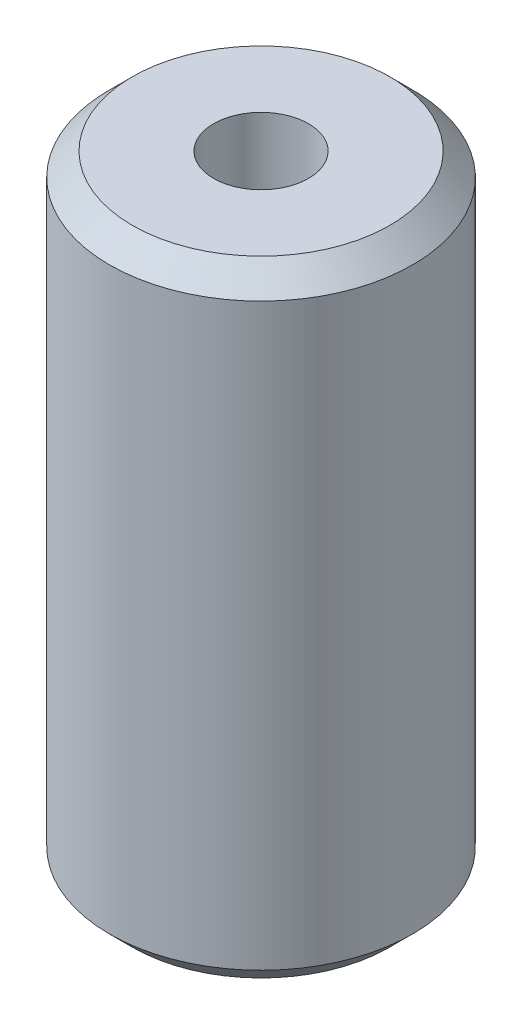
ISO-10303-21;
HEADER;
FILE_DESCRIPTION(('STEP AP214'),'2;1');
FILE_NAME('part.step','',(''),(''),'','','');
FILE_SCHEMA(('AUTOMOTIVE_DESIGN { 1 0 10303 214 1 1 1 1 }'));
ENDSEC;
DATA;
#1=APPLICATION_CONTEXT('core data for automotive mechanical design processes');
#2=APPLICATION_PROTOCOL_DEFINITION('international standard','automotive_design',2000,#1);
#3=PRODUCT_CONTEXT('',#1,'mechanical');
#4=PRODUCT('Part','Part','',(#3));
#5=PRODUCT_RELATED_PRODUCT_CATEGORY('part','',(#4));
#6=PRODUCT_DEFINITION_FORMATION('','',#4);
#7=PRODUCT_DEFINITION_CONTEXT('part definition',#1,'design');
#8=PRODUCT_DEFINITION('design','',#6,#7);
#9=PRODUCT_DEFINITION_SHAPE('','',#8);
#10=(LENGTH_UNIT() NAMED_UNIT(*) SI_UNIT(.MILLI.,.METRE.));
#11=(NAMED_UNIT(*) PLANE_ANGLE_UNIT() SI_UNIT($,.RADIAN.));
#12=(NAMED_UNIT(*) SI_UNIT($,.STERADIAN.) SOLID_ANGLE_UNIT());
#13=UNCERTAINTY_MEASURE_WITH_UNIT(LENGTH_MEASURE(1.E-05),#10,'distance_accuracy_value','');
#14=(GEOMETRIC_REPRESENTATION_CONTEXT(3) GLOBAL_UNCERTAINTY_ASSIGNED_CONTEXT((#13)) GLOBAL_UNIT_ASSIGNED_CONTEXT((#10,
#11,#12)) REPRESENTATION_CONTEXT('',''));
#15=CARTESIAN_POINT('',(0.,0.,0.));
#16=DIRECTION('',(0.,0.,1.));
#17=DIRECTION('',(1.,0.,0.));
#18=AXIS2_PLACEMENT_3D('',#15,#16,#17);
#19=CARTESIAN_POINT('',(0.,41.245399228994,0.));
#20=DIRECTION('',(0.,-1.,0.));
#21=DIRECTION('',(0.,0.,-1.));
#22=AXIS2_PLACEMENT_3D('',#19,#20,#21);
#23=CYLINDRICAL_SURFACE('',#22,10.);
#24=CARTESIAN_POINT('',(0.,39.7406930189937,0.));
#25=DIRECTION('',(0.,1.,0.));
#26=DIRECTION('',(0.,0.,1.));
#27=AXIS2_PLACEMENT_3D('',#24,#25,#26);
#28=CIRCLE('',#27,10.);
#29=CARTESIAN_POINT('',(0.,39.7406930189937,10.));
#30=VERTEX_POINT('',#29);
#31=EDGE_CURVE('E50',#30,#30,#28,.F.);
#32=ORIENTED_EDGE('',*,*,#31,.T.);
#33=EDGE_LOOP('',(#32));
#34=FACE_BOUND('',#33,.T.);
#35=CARTESIAN_POINT('',(0.,1.50470621000023,0.));
#36=DIRECTION('',(0.,1.,0.));
#37=DIRECTION('',(0.,0.,1.));
#38=AXIS2_PLACEMENT_3D('',#35,#36,#37);
#39=CIRCLE('',#38,10.);
#40=CARTESIAN_POINT('',(0.,1.50470621000023,10.));
#41=VERTEX_POINT('',#40);
#42=EDGE_CURVE('E51',#41,#41,#39,.T.);
#43=ORIENTED_EDGE('',*,*,#42,.T.);
#44=EDGE_LOOP('',(#43));
#45=FACE_BOUND('',#44,.T.);
#46=ADVANCED_FACE('F39',(#34,#45),#23,.T.);
#47=CARTESIAN_POINT('',(0.,41.245399228994,0.));
#48=DIRECTION('',(0.,1.,0.));
#49=DIRECTION('',(0.,0.,1.));
#50=AXIS2_PLACEMENT_3D('',#47,#48,#49);
#51=PLANE('',#50);
#52=CARTESIAN_POINT('',(0.,41.245399228994,0.));
#53=DIRECTION('',(0.,1.,0.));
#54=DIRECTION('',(0.,0.,1.));
#55=AXIS2_PLACEMENT_3D('',#52,#53,#54);
#56=CIRCLE('',#55,8.49529378999977);
#57=CARTESIAN_POINT('',(0.,41.245399228994,8.49529378999977));
#58=VERTEX_POINT('',#57);
#59=EDGE_CURVE('E54',#58,#58,#56,.T.);
#60=ORIENTED_EDGE('',*,*,#59,.T.);
#61=EDGE_LOOP('',(#60));
#62=FACE_BOUND('',#61,.T.);
#63=CARTESIAN_POINT('',(0.,41.245399228994,0.));
#64=DIRECTION('',(0.,1.,0.));
#65=DIRECTION('',(0.,0.,1.));
#66=AXIS2_PLACEMENT_3D('',#63,#64,#65);
#67=CIRCLE('',#66,3.13083071335313);
#68=CARTESIAN_POINT('',(0.,41.245399228994,3.13083071335313));
#69=VERTEX_POINT('',#68);
#70=EDGE_CURVE('E58',#69,#69,#67,.T.);
#71=ORIENTED_EDGE('',*,*,#70,.F.);
#72=EDGE_LOOP('',(#71));
#73=FACE_BOUND('',#72,.T.);
#74=ADVANCED_FACE('F69',(#62,#73),#51,.T.);
#75=CARTESIAN_POINT('',(0.,0.,0.));
#76=DIRECTION('',(0.,1.,0.));
#77=DIRECTION('',(0.,0.,1.));
#78=AXIS2_PLACEMENT_3D('',#75,#76,#77);
#79=PLANE('',#78);
#80=CARTESIAN_POINT('',(0.,0.,0.));
#81=DIRECTION('',(0.,1.,0.));
#82=DIRECTION('',(0.,0.,1.));
#83=AXIS2_PLACEMENT_3D('',#80,#81,#82);
#84=CIRCLE('',#83,8.49529378999976);
#85=CARTESIAN_POINT('',(0.,0.,8.49529378999976));
#86=VERTEX_POINT('',#85);
#87=EDGE_CURVE('E10',#86,#86,#84,.F.);
#88=ORIENTED_EDGE('',*,*,#87,.T.);
#89=EDGE_LOOP('',(#88));
#90=FACE_BOUND('',#89,.T.);
#91=CARTESIAN_POINT('',(0.,0.,0.));
#92=DIRECTION('',(0.,1.,0.));
#93=DIRECTION('',(0.,0.,1.));
#94=AXIS2_PLACEMENT_3D('',#91,#92,#93);
#95=CIRCLE('',#94,3.13083071335313);
#96=CARTESIAN_POINT('',(0.,0.,3.13083071335313));
#97=VERTEX_POINT('',#96);
#98=EDGE_CURVE('E63',#97,#97,#95,.T.);
#99=ORIENTED_EDGE('',*,*,#98,.T.);
#100=EDGE_LOOP('',(#99));
#101=FACE_BOUND('',#100,.T.);
#102=ADVANCED_FACE('F75',(#90,#101),#79,.F.);
#103=CARTESIAN_POINT('',(0.,41.245399228994,0.));
#104=DIRECTION('',(0.,-1.,0.));
#105=DIRECTION('',(0.,0.,-1.));
#106=AXIS2_PLACEMENT_3D('',#103,#104,#105);
#107=CYLINDRICAL_SURFACE('',#106,3.13083071335313);
#108=ORIENTED_EDGE('',*,*,#70,.T.);
#109=EDGE_LOOP('',(#108));
#110=FACE_BOUND('',#109,.T.);
#111=ORIENTED_EDGE('',*,*,#98,.F.);
#112=EDGE_LOOP('',(#111));
#113=FACE_BOUND('',#112,.T.);
#114=ADVANCED_FACE('F70',(#110,#113),#107,.F.);
#115=CARTESIAN_POINT('',(0.,41.245399228994,0.));
#116=DIRECTION('',(0.,-1.,0.));
#117=DIRECTION('',(0.,0.,-1.));
#118=AXIS2_PLACEMENT_3D('',#115,#116,#117);
#119=CONICAL_SURFACE('',#118,8.49529378999977,0.785398163397443);
#120=ORIENTED_EDGE('',*,*,#31,.F.);
#121=EDGE_LOOP('',(#120));
#122=FACE_BOUND('',#121,.T.);
#123=ORIENTED_EDGE('',*,*,#59,.F.);
#124=EDGE_LOOP('',(#123));
#125=FACE_BOUND('',#124,.T.);
#126=ADVANCED_FACE('F81',(#122,#125),#119,.T.);
#127=CARTESIAN_POINT('',(0.,1.50470621000023,0.));
#128=DIRECTION('',(0.,1.,0.));
#129=DIRECTION('',(0.,0.,1.));
#130=AXIS2_PLACEMENT_3D('',#127,#128,#129);
#131=CONICAL_SURFACE('',#130,10.,0.785398163397454);
#132=ORIENTED_EDGE('',*,*,#87,.F.);
#133=EDGE_LOOP('',(#132));
#134=FACE_BOUND('',#133,.T.);
#135=ORIENTED_EDGE('',*,*,#42,.F.);
#136=EDGE_LOOP('',(#135));
#137=FACE_BOUND('',#136,.T.);
#138=ADVANCED_FACE('F45',(#134,#137),#131,.T.);
#139=CLOSED_SHELL('',(#46,#74,#102,#114,#126,#138));
#140=MANIFOLD_SOLID_BREP('B2',#139);
#141=ADVANCED_BREP_SHAPE_REPRESENTATION('',(#18,#140),#14);
#142=SHAPE_DEFINITION_REPRESENTATION(#9,#141);
ENDSEC;
END-ISO-10303-21;
